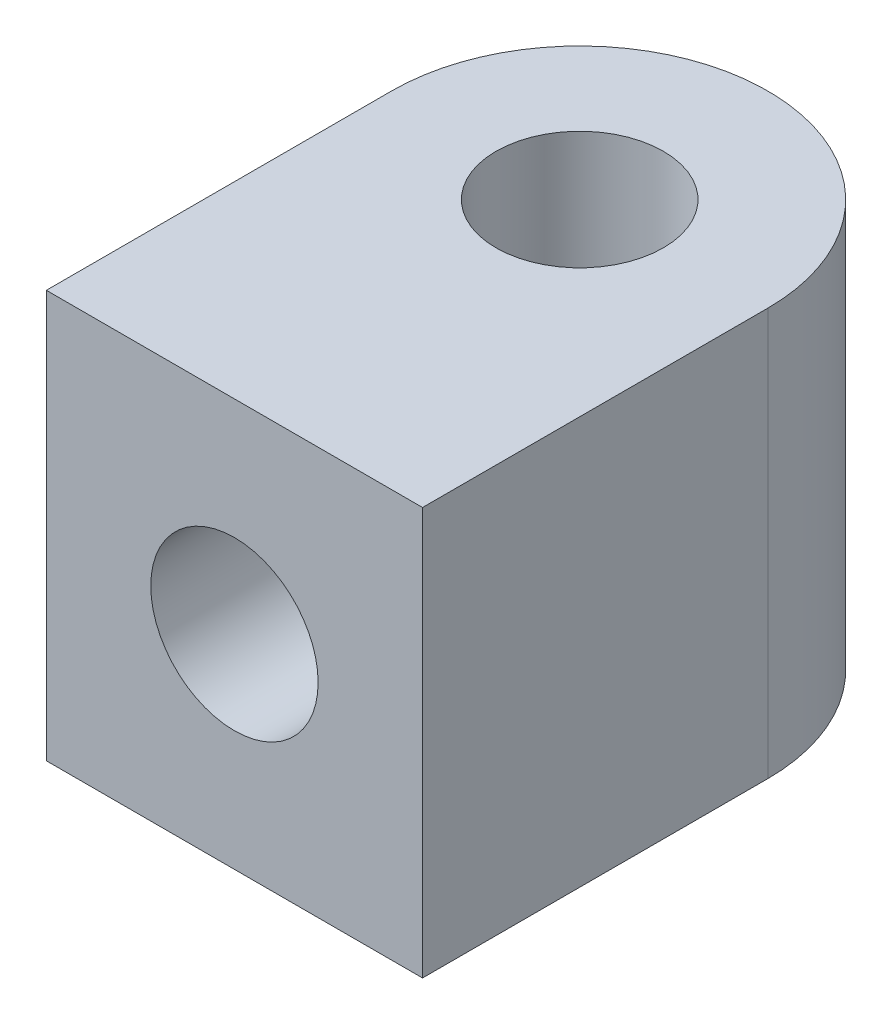
ISO-10303-21;
HEADER;
FILE_DESCRIPTION(('STEP AP214'),'2;1');
FILE_NAME('part.step','',(''),(''),'','','');
FILE_SCHEMA(('AUTOMOTIVE_DESIGN { 1 0 10303 214 1 1 1 1 }'));
ENDSEC;
DATA;
#1=APPLICATION_CONTEXT('core data for automotive mechanical design processes');
#2=APPLICATION_PROTOCOL_DEFINITION('international standard','automotive_design',2000,#1);
#3=PRODUCT_CONTEXT('',#1,'mechanical');
#4=PRODUCT('Part','Part','',(#3));
#5=PRODUCT_RELATED_PRODUCT_CATEGORY('part','',(#4));
#6=PRODUCT_DEFINITION_FORMATION('','',#4);
#7=PRODUCT_DEFINITION_CONTEXT('part definition',#1,'design');
#8=PRODUCT_DEFINITION('design','',#6,#7);
#9=PRODUCT_DEFINITION_SHAPE('','',#8);
#10=(LENGTH_UNIT() NAMED_UNIT(*) SI_UNIT(.MILLI.,.METRE.));
#11=(NAMED_UNIT(*) PLANE_ANGLE_UNIT() SI_UNIT($,.RADIAN.));
#12=(NAMED_UNIT(*) SI_UNIT($,.STERADIAN.) SOLID_ANGLE_UNIT());
#13=UNCERTAINTY_MEASURE_WITH_UNIT(LENGTH_MEASURE(1.E-05),#10,'distance_accuracy_value','');
#14=(GEOMETRIC_REPRESENTATION_CONTEXT(3) GLOBAL_UNCERTAINTY_ASSIGNED_CONTEXT((#13)) GLOBAL_UNIT_ASSIGNED_CONTEXT((#10,
#11,#12)) REPRESENTATION_CONTEXT('',''));
#15=CARTESIAN_POINT('',(0.,0.,0.));
#16=DIRECTION('',(0.,0.,1.));
#17=DIRECTION('',(1.,0.,0.));
#18=AXIS2_PLACEMENT_3D('',#15,#16,#17);
#19=CARTESIAN_POINT('',(0.,3.29311,5.58038));
#20=DIRECTION('',(0.,0.,1.));
#21=DIRECTION('',(1.,0.,0.));
#22=AXIS2_PLACEMENT_3D('',#19,#20,#21);
#23=CYLINDRICAL_SURFACE('',#22,1.35254999999999);
#24=CARTESIAN_POINT('',(0.,3.29311,0.));
#25=DIRECTION('',(0.,-0.707106781186547,0.707106781186547));
#26=DIRECTION('',(0.,0.707106781186547,0.707106781186547));
#27=AXIS2_PLACEMENT_3D('',#24,#25,#26);
#28=ELLIPSE('',#27,1.91279455378772,1.35254999999999);
#29=CARTESIAN_POINT('',(-1.35254999999999,3.29311,0.));
#30=VERTEX_POINT('',#29);
#31=CARTESIAN_POINT('',(1.35254999999999,3.29311,0.));
#32=VERTEX_POINT('',#31);
#33=EDGE_CURVE('E65',#30,#32,#28,.F.);
#34=ORIENTED_EDGE('',*,*,#33,.T.);
#35=CARTESIAN_POINT('',(0.,3.29311,0.));
#36=DIRECTION('',(0.,0.707106781186547,0.707106781186547));
#37=DIRECTION('',(0.,-0.707106781186547,0.707106781186547));
#38=AXIS2_PLACEMENT_3D('',#35,#36,#37);
#39=ELLIPSE('',#38,1.91279455378772,1.35254999999999);
#40=EDGE_CURVE('E20',#32,#30,#39,.F.);
#41=ORIENTED_EDGE('',*,*,#40,.T.);
#42=EDGE_LOOP('',(#34,#41));
#43=FACE_BOUND('',#42,.T.);
#44=CARTESIAN_POINT('',(0.,3.29311,5.58038));
#45=DIRECTION('',(0.,0.,1.));
#46=DIRECTION('',(1.,0.,0.));
#47=AXIS2_PLACEMENT_3D('',#44,#45,#46);
#48=CIRCLE('',#47,1.35254999999999);
#49=CARTESIAN_POINT('',(1.35254999999999,3.29311,5.58038));
#50=VERTEX_POINT('',#49);
#51=EDGE_CURVE('E74',#50,#50,#48,.T.);
#52=ORIENTED_EDGE('',*,*,#51,.T.);
#53=EDGE_LOOP('',(#52));
#54=FACE_BOUND('',#53,.T.);
#55=ADVANCED_FACE('F17',(#43,#54),#23,.F.);
#56=CARTESIAN_POINT('',(0.,0.,0.));
#57=DIRECTION('',(0.,1.,0.));
#58=DIRECTION('',(0.,0.,1.));
#59=AXIS2_PLACEMENT_3D('',#56,#57,#58);
#60=PLANE('',#59);
#61=DIRECTION('',(0.,0.,1.));
#62=VECTOR('',#61,1.);
#63=CARTESIAN_POINT('',(3.04038,0.,5.58038));
#64=LINE('',#63,#62);
#65=CARTESIAN_POINT('',(3.04038,0.,0.));
#66=VERTEX_POINT('',#65);
#67=CARTESIAN_POINT('',(3.04038,0.,5.58038));
#68=VERTEX_POINT('',#67);
#69=EDGE_CURVE('E83',#66,#68,#64,.T.);
#70=ORIENTED_EDGE('',*,*,#69,.T.);
#71=DIRECTION('',(-1.,0.,0.));
#72=VECTOR('',#71,1.);
#73=CARTESIAN_POINT('',(-3.04038,0.,5.58038));
#74=LINE('',#73,#72);
#75=CARTESIAN_POINT('',(-3.04038,0.,5.58038));
#76=VERTEX_POINT('',#75);
#77=EDGE_CURVE('E88',#68,#76,#74,.T.);
#78=ORIENTED_EDGE('',*,*,#77,.T.);
#79=DIRECTION('',(0.,0.,-1.));
#80=VECTOR('',#79,1.);
#81=CARTESIAN_POINT('',(-3.04038,0.,0.));
#82=LINE('',#81,#80);
#83=CARTESIAN_POINT('',(-3.04038,0.,0.));
#84=VERTEX_POINT('',#83);
#85=EDGE_CURVE('E78',#76,#84,#82,.T.);
#86=ORIENTED_EDGE('',*,*,#85,.T.);
#87=CARTESIAN_POINT('',(0.,0.,0.));
#88=DIRECTION('',(0.,-1.,0.));
#89=DIRECTION('',(0.,0.,-1.));
#90=AXIS2_PLACEMENT_3D('',#87,#88,#89);
#91=CIRCLE('',#90,3.04038);
#92=EDGE_CURVE('E69',#66,#84,#91,.F.);
#93=ORIENTED_EDGE('',*,*,#92,.F.);
#94=EDGE_LOOP('',(#70,#78,#86,#93));
#95=FACE_BOUND('',#94,.T.);
#96=CARTESIAN_POINT('',(0.,0.,0.));
#97=DIRECTION('',(0.,1.,0.));
#98=DIRECTION('',(0.,0.,1.));
#99=AXIS2_PLACEMENT_3D('',#96,#97,#98);
#100=CIRCLE('',#99,1.35254999999999);
#101=CARTESIAN_POINT('',(0.,0.,1.35254999999999));
#102=VERTEX_POINT('',#101);
#103=EDGE_CURVE('E67',#102,#102,#100,.T.);
#104=ORIENTED_EDGE('',*,*,#103,.T.);
#105=EDGE_LOOP('',(#104));
#106=FACE_BOUND('',#105,.T.);
#107=ADVANCED_FACE('F118',(#95,#106),#60,.F.);
#108=CARTESIAN_POINT('',(0.,6.58622,0.));
#109=DIRECTION('',(0.,1.,0.));
#110=DIRECTION('',(0.,0.,1.));
#111=AXIS2_PLACEMENT_3D('',#108,#109,#110);
#112=CYLINDRICAL_SURFACE('',#111,1.35254999999999);
#113=ORIENTED_EDGE('',*,*,#40,.F.);
#114=ORIENTED_EDGE('',*,*,#33,.F.);
#115=EDGE_LOOP('',(#113,#114));
#116=FACE_BOUND('',#115,.T.);
#117=CARTESIAN_POINT('',(0.,6.58622,0.));
#118=DIRECTION('',(0.,1.,0.));
#119=DIRECTION('',(0.,0.,1.));
#120=AXIS2_PLACEMENT_3D('',#117,#118,#119);
#121=CIRCLE('',#120,1.35254999999999);
#122=CARTESIAN_POINT('',(0.,6.58622,1.35254999999999));
#123=VERTEX_POINT('',#122);
#124=EDGE_CURVE('E79',#123,#123,#121,.F.);
#125=ORIENTED_EDGE('',*,*,#124,.F.);
#126=EDGE_LOOP('',(#125));
#127=FACE_BOUND('',#126,.T.);
#128=ORIENTED_EDGE('',*,*,#103,.F.);
#129=EDGE_LOOP('',(#128));
#130=FACE_BOUND('',#129,.T.);
#131=ADVANCED_FACE('F63',(#116,#127,#130),#112,.F.);
#132=CARTESIAN_POINT('',(0.,6.58622,0.));
#133=DIRECTION('',(0.,-1.,0.));
#134=DIRECTION('',(0.,0.,-1.));
#135=AXIS2_PLACEMENT_3D('',#132,#133,#134);
#136=CYLINDRICAL_SURFACE('',#135,3.04038);
#137=ORIENTED_EDGE('',*,*,#92,.T.);
#138=DIRECTION('',(0.,1.,0.));
#139=VECTOR('',#138,1.);
#140=CARTESIAN_POINT('',(-3.04038,6.58622,0.));
#141=LINE('',#140,#139);
#142=CARTESIAN_POINT('',(-3.04038,6.58622,0.));
#143=VERTEX_POINT('',#142);
#144=EDGE_CURVE('E73',#84,#143,#141,.T.);
#145=ORIENTED_EDGE('',*,*,#144,.T.);
#146=CARTESIAN_POINT('',(0.,6.58622,0.));
#147=DIRECTION('',(0.,-1.,0.));
#148=DIRECTION('',(0.,0.,-1.));
#149=AXIS2_PLACEMENT_3D('',#146,#147,#148);
#150=CIRCLE('',#149,3.04038);
#151=CARTESIAN_POINT('',(3.04038,6.58622,0.));
#152=VERTEX_POINT('',#151);
#153=EDGE_CURVE('E82',#152,#143,#150,.F.);
#154=ORIENTED_EDGE('',*,*,#153,.F.);
#155=DIRECTION('',(0.,1.,0.));
#156=VECTOR('',#155,1.);
#157=CARTESIAN_POINT('',(3.04038,6.58622,0.));
#158=LINE('',#157,#156);
#159=EDGE_CURVE('E93',#152,#66,#158,.F.);
#160=ORIENTED_EDGE('',*,*,#159,.T.);
#161=EDGE_LOOP('',(#137,#145,#154,#160));
#162=FACE_BOUND('',#161,.T.);
#163=ADVANCED_FACE('F133',(#162),#136,.T.);
#164=CARTESIAN_POINT('',(-3.04038,6.58622,0.));
#165=DIRECTION('',(1.,0.,0.));
#166=DIRECTION('',(0.,0.,-1.));
#167=AXIS2_PLACEMENT_3D('',#164,#165,#166);
#168=PLANE('',#167);
#169=DIRECTION('',(0.,1.,0.));
#170=VECTOR('',#169,1.);
#171=CARTESIAN_POINT('',(-3.04038,6.58622,5.58038));
#172=LINE('',#171,#170);
#173=CARTESIAN_POINT('',(-3.04038,6.58622,5.58038));
#174=VERTEX_POINT('',#173);
#175=EDGE_CURVE('E77',#76,#174,#172,.T.);
#176=ORIENTED_EDGE('',*,*,#175,.T.);
#177=DIRECTION('',(0.,0.,1.));
#178=VECTOR('',#177,1.);
#179=CARTESIAN_POINT('',(-3.04038,6.58622,0.));
#180=LINE('',#179,#178);
#181=EDGE_CURVE('E85',#143,#174,#180,.T.);
#182=ORIENTED_EDGE('',*,*,#181,.F.);
#183=ORIENTED_EDGE('',*,*,#144,.F.);
#184=ORIENTED_EDGE('',*,*,#85,.F.);
#185=EDGE_LOOP('',(#176,#182,#183,#184));
#186=FACE_BOUND('',#185,.T.);
#187=ADVANCED_FACE('F109',(#186),#168,.F.);
#188=CARTESIAN_POINT('',(-3.04038,6.58622,5.58038));
#189=DIRECTION('',(0.,0.,-1.));
#190=DIRECTION('',(-1.,0.,0.));
#191=AXIS2_PLACEMENT_3D('',#188,#189,#190);
#192=PLANE('',#191);
#193=DIRECTION('',(0.,1.,0.));
#194=VECTOR('',#193,1.);
#195=CARTESIAN_POINT('',(3.04038,6.58622,5.58038));
#196=LINE('',#195,#194);
#197=CARTESIAN_POINT('',(3.04038,6.58622,5.58038));
#198=VERTEX_POINT('',#197);
#199=EDGE_CURVE('E35',#68,#198,#196,.T.);
#200=ORIENTED_EDGE('',*,*,#199,.T.);
#201=DIRECTION('',(1.,0.,0.));
#202=VECTOR('',#201,1.);
#203=CARTESIAN_POINT('',(0.,6.58622,5.58038));
#204=LINE('',#203,#202);
#205=EDGE_CURVE('E26',#174,#198,#204,.T.);
#206=ORIENTED_EDGE('',*,*,#205,.F.);
#207=ORIENTED_EDGE('',*,*,#175,.F.);
#208=ORIENTED_EDGE('',*,*,#77,.F.);
#209=EDGE_LOOP('',(#200,#206,#207,#208));
#210=FACE_BOUND('',#209,.T.);
#211=ORIENTED_EDGE('',*,*,#51,.F.);
#212=EDGE_LOOP('',(#211));
#213=FACE_BOUND('',#212,.T.);
#214=ADVANCED_FACE('F111',(#210,#213),#192,.F.);
#215=CARTESIAN_POINT('',(3.04038,6.58622,5.58038));
#216=DIRECTION('',(-1.,0.,0.));
#217=DIRECTION('',(0.,0.,1.));
#218=AXIS2_PLACEMENT_3D('',#215,#216,#217);
#219=PLANE('',#218);
#220=ORIENTED_EDGE('',*,*,#159,.F.);
#221=DIRECTION('',(0.,0.,1.));
#222=VECTOR('',#221,1.);
#223=CARTESIAN_POINT('',(3.04038,6.58622,0.));
#224=LINE('',#223,#222);
#225=EDGE_CURVE('E10',#198,#152,#224,.F.);
#226=ORIENTED_EDGE('',*,*,#225,.F.);
#227=ORIENTED_EDGE('',*,*,#199,.F.);
#228=ORIENTED_EDGE('',*,*,#69,.F.);
#229=EDGE_LOOP('',(#220,#226,#227,#228));
#230=FACE_BOUND('',#229,.T.);
#231=ADVANCED_FACE('F114',(#230),#219,.F.);
#232=CARTESIAN_POINT('',(0.,6.58622,0.));
#233=DIRECTION('',(0.,1.,0.));
#234=DIRECTION('',(0.,0.,1.));
#235=AXIS2_PLACEMENT_3D('',#232,#233,#234);
#236=PLANE('',#235);
#237=ORIENTED_EDGE('',*,*,#205,.T.);
#238=ORIENTED_EDGE('',*,*,#225,.T.);
#239=ORIENTED_EDGE('',*,*,#153,.T.);
#240=ORIENTED_EDGE('',*,*,#181,.T.);
#241=EDGE_LOOP('',(#237,#238,#239,#240));
#242=FACE_BOUND('',#241,.T.);
#243=ORIENTED_EDGE('',*,*,#124,.T.);
#244=EDGE_LOOP('',(#243));
#245=FACE_BOUND('',#244,.T.);
#246=ADVANCED_FACE('F105',(#242,#245),#236,.T.);
#247=CLOSED_SHELL('',(#55,#107,#131,#163,#187,#214,#231,#246));
#248=MANIFOLD_SOLID_BREP('B1',#247);
#249=ADVANCED_BREP_SHAPE_REPRESENTATION('',(#18,#248),#14);
#250=SHAPE_DEFINITION_REPRESENTATION(#9,#249);
ENDSEC;
END-ISO-10303-21;
